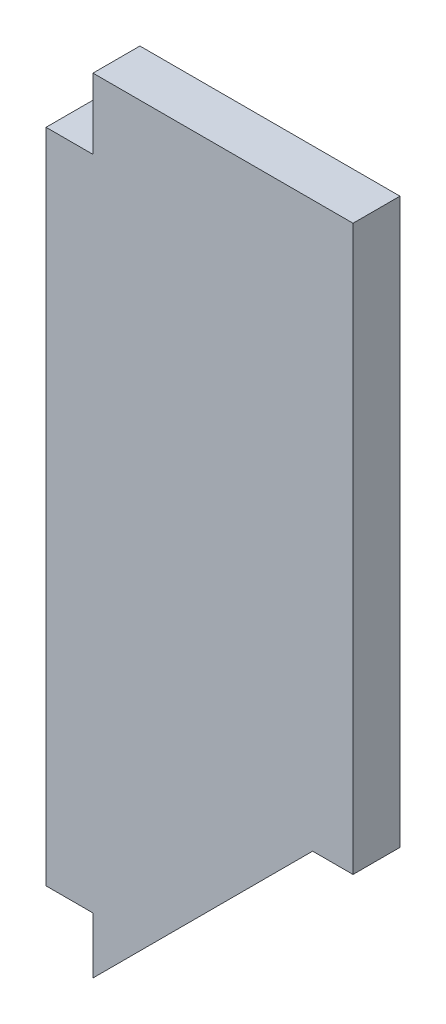
ISO-10303-21;
HEADER;
FILE_DESCRIPTION(('STEP AP214'),'2;1');
FILE_NAME('part.step','',(''),(''),'','','');
FILE_SCHEMA(('AUTOMOTIVE_DESIGN { 1 0 10303 214 1 1 1 1 }'));
ENDSEC;
DATA;
#1=APPLICATION_CONTEXT('core data for automotive mechanical design processes');
#2=APPLICATION_PROTOCOL_DEFINITION('international standard','automotive_design',2000,#1);
#3=PRODUCT_CONTEXT('',#1,'mechanical');
#4=PRODUCT('Part','Part','',(#3));
#5=PRODUCT_RELATED_PRODUCT_CATEGORY('part','',(#4));
#6=PRODUCT_DEFINITION_FORMATION('','',#4);
#7=PRODUCT_DEFINITION_CONTEXT('part definition',#1,'design');
#8=PRODUCT_DEFINITION('design','',#6,#7);
#9=PRODUCT_DEFINITION_SHAPE('','',#8);
#10=(LENGTH_UNIT() NAMED_UNIT(*) SI_UNIT(.MILLI.,.METRE.));
#11=(NAMED_UNIT(*) PLANE_ANGLE_UNIT() SI_UNIT($,.RADIAN.));
#12=(NAMED_UNIT(*) SI_UNIT($,.STERADIAN.) SOLID_ANGLE_UNIT());
#13=UNCERTAINTY_MEASURE_WITH_UNIT(LENGTH_MEASURE(1.E-05),#10,'distance_accuracy_value','');
#14=(GEOMETRIC_REPRESENTATION_CONTEXT(3) GLOBAL_UNCERTAINTY_ASSIGNED_CONTEXT((#13)) GLOBAL_UNIT_ASSIGNED_CONTEXT((#10,
#11,#12)) REPRESENTATION_CONTEXT('',''));
#15=CARTESIAN_POINT('',(0.,0.,0.));
#16=DIRECTION('',(0.,0.,1.));
#17=DIRECTION('',(1.,0.,0.));
#18=AXIS2_PLACEMENT_3D('',#15,#16,#17);
#19=CARTESIAN_POINT('',(0.,0.,12.7));
#20=DIRECTION('',(1.,0.,0.));
#21=DIRECTION('',(0.,1.,0.));
#22=AXIS2_PLACEMENT_3D('',#19,#20,#21);
#23=PLANE('',#22);
#24=DIRECTION('',(0.,-1.,0.));
#25=VECTOR('',#24,1.);
#26=CARTESIAN_POINT('',(0.,0.,12.7));
#27=LINE('',#26,#25);
#28=CARTESIAN_POINT('',(0.,-19.05,12.7));
#29=VERTEX_POINT('',#28);
#30=CARTESIAN_POINT('',(0.,-196.85,12.7));
#31=VERTEX_POINT('',#30);
#32=EDGE_CURVE('E122',#29,#31,#27,.T.);
#33=ORIENTED_EDGE('',*,*,#32,.F.);
#34=DIRECTION('',(0.,0.,1.));
#35=VECTOR('',#34,1.);
#36=CARTESIAN_POINT('',(0.,-19.05,0.));
#37=LINE('',#36,#35);
#38=CARTESIAN_POINT('',(0.,-19.05,0.));
#39=VERTEX_POINT('',#38);
#40=EDGE_CURVE('E109',#39,#29,#37,.T.);
#41=ORIENTED_EDGE('',*,*,#40,.F.);
#42=DIRECTION('',(0.,-1.,0.));
#43=VECTOR('',#42,1.);
#44=CARTESIAN_POINT('',(0.,0.,0.));
#45=LINE('',#44,#43);
#46=CARTESIAN_POINT('',(0.,-196.85,0.));
#47=VERTEX_POINT('',#46);
#48=EDGE_CURVE('E120',#39,#47,#45,.T.);
#49=ORIENTED_EDGE('',*,*,#48,.T.);
#50=DIRECTION('',(0.,0.,1.));
#51=VECTOR('',#50,1.);
#52=CARTESIAN_POINT('',(0.,-196.85,0.));
#53=LINE('',#52,#51);
#54=EDGE_CURVE('E181',#47,#31,#53,.T.);
#55=ORIENTED_EDGE('',*,*,#54,.T.);
#56=EDGE_LOOP('',(#33,#41,#49,#55));
#57=FACE_BOUND('',#56,.T.);
#58=ADVANCED_FACE('F35',(#57),#23,.F.);
#59=CARTESIAN_POINT('',(8.89000000000003,-215.9,12.7));
#60=DIRECTION('',(-0.707106781186548,0.707106781186547,0.));
#61=DIRECTION('',(-0.707106781186547,-0.707106781186548,0.));
#62=AXIS2_PLACEMENT_3D('',#59,#60,#61);
#63=PLANE('',#62);
#64=DIRECTION('',(0.707106781186547,0.707106781186548,0.));
#65=VECTOR('',#64,1.);
#66=CARTESIAN_POINT('',(8.89000000000003,-215.9,12.7));
#67=LINE('',#66,#65);
#68=CARTESIAN_POINT('',(12.7,-212.09,12.7));
#69=VERTEX_POINT('',#68);
#70=CARTESIAN_POINT('',(72.1486750348032,-152.641324965197,12.7));
#71=VERTEX_POINT('',#70);
#72=EDGE_CURVE('E175',#69,#71,#67,.T.);
#73=ORIENTED_EDGE('',*,*,#72,.F.);
#74=DIRECTION('',(0.,0.,-1.));
#75=VECTOR('',#74,1.);
#76=CARTESIAN_POINT('',(12.7,-212.09,12.7));
#77=LINE('',#76,#75);
#78=CARTESIAN_POINT('',(12.7,-212.09,0.));
#79=VERTEX_POINT('',#78);
#80=EDGE_CURVE('E126',#69,#79,#77,.T.);
#81=ORIENTED_EDGE('',*,*,#80,.T.);
#82=DIRECTION('',(0.707106781186547,0.707106781186548,0.));
#83=VECTOR('',#82,1.);
#84=CARTESIAN_POINT('',(8.89000000000003,-215.9,0.));
#85=LINE('',#84,#83);
#86=CARTESIAN_POINT('',(72.1486750348032,-152.641324965197,0.));
#87=VERTEX_POINT('',#86);
#88=EDGE_CURVE('E125',#79,#87,#85,.T.);
#89=ORIENTED_EDGE('',*,*,#88,.T.);
#90=DIRECTION('',(0.,0.,-1.));
#91=VECTOR('',#90,1.);
#92=CARTESIAN_POINT('',(72.1486750348032,-152.641324965197,12.7));
#93=LINE('',#92,#91);
#94=EDGE_CURVE('E42',#71,#87,#93,.T.);
#95=ORIENTED_EDGE('',*,*,#94,.F.);
#96=EDGE_LOOP('',(#73,#81,#89,#95));
#97=FACE_BOUND('',#96,.T.);
#98=ADVANCED_FACE('F205',(#97),#63,.F.);
#99=CARTESIAN_POINT('',(72.1486750348032,-152.641324965197,12.7));
#100=DIRECTION('',(0.,1.,0.));
#101=DIRECTION('',(0.,0.,1.));
#102=AXIS2_PLACEMENT_3D('',#99,#100,#101);
#103=PLANE('',#102);
#104=DIRECTION('',(1.,0.,0.));
#105=VECTOR('',#104,1.);
#106=CARTESIAN_POINT('',(72.1486750348032,-152.641324965197,0.));
#107=LINE('',#106,#105);
#108=CARTESIAN_POINT('',(83.0805412377398,-152.641324965197,0.));
#109=VERTEX_POINT('',#108);
#110=EDGE_CURVE('E128',#87,#109,#107,.T.);
#111=ORIENTED_EDGE('',*,*,#110,.T.);
#112=DIRECTION('',(0.,0.,-1.));
#113=VECTOR('',#112,1.);
#114=CARTESIAN_POINT('',(83.0805412377398,-152.641324965197,12.7));
#115=LINE('',#114,#113);
#116=CARTESIAN_POINT('',(83.0805412377398,-152.641324965197,12.7));
#117=VERTEX_POINT('',#116);
#118=EDGE_CURVE('E147',#117,#109,#115,.T.);
#119=ORIENTED_EDGE('',*,*,#118,.F.);
#120=DIRECTION('',(1.,0.,0.));
#121=VECTOR('',#120,1.);
#122=CARTESIAN_POINT('',(72.1486750348032,-152.641324965197,12.7));
#123=LINE('',#122,#121);
#124=EDGE_CURVE('E156',#71,#117,#123,.T.);
#125=ORIENTED_EDGE('',*,*,#124,.F.);
#126=ORIENTED_EDGE('',*,*,#94,.T.);
#127=EDGE_LOOP('',(#111,#119,#125,#126));
#128=FACE_BOUND('',#127,.T.);
#129=ADVANCED_FACE('F154',(#128),#103,.F.);
#130=CARTESIAN_POINT('',(83.0805412377398,0.,12.7));
#131=DIRECTION('',(-1.,0.,0.));
#132=DIRECTION('',(0.,-1.,0.));
#133=AXIS2_PLACEMENT_3D('',#130,#131,#132);
#134=PLANE('',#133);
#135=DIRECTION('',(0.,1.,0.));
#136=VECTOR('',#135,1.);
#137=CARTESIAN_POINT('',(83.0805412377398,0.,0.));
#138=LINE('',#137,#136);
#139=CARTESIAN_POINT('',(83.0805412377398,0.,0.));
#140=VERTEX_POINT('',#139);
#141=EDGE_CURVE('E138',#109,#140,#138,.T.);
#142=ORIENTED_EDGE('',*,*,#141,.T.);
#143=DIRECTION('',(0.,0.,-1.));
#144=VECTOR('',#143,1.);
#145=CARTESIAN_POINT('',(83.0805412377398,0.,12.7));
#146=LINE('',#145,#144);
#147=CARTESIAN_POINT('',(83.0805412377398,0.,12.7));
#148=VERTEX_POINT('',#147);
#149=EDGE_CURVE('E144',#148,#140,#146,.T.);
#150=ORIENTED_EDGE('',*,*,#149,.F.);
#151=DIRECTION('',(0.,1.,0.));
#152=VECTOR('',#151,1.);
#153=CARTESIAN_POINT('',(83.0805412377398,0.,12.7));
#154=LINE('',#153,#152);
#155=EDGE_CURVE('E134',#117,#148,#154,.T.);
#156=ORIENTED_EDGE('',*,*,#155,.F.);
#157=ORIENTED_EDGE('',*,*,#118,.T.);
#158=EDGE_LOOP('',(#142,#150,#156,#157));
#159=FACE_BOUND('',#158,.T.);
#160=ADVANCED_FACE('F164',(#159),#134,.F.);
#161=CARTESIAN_POINT('',(76.7305412377398,0.,12.7));
#162=DIRECTION('',(0.,-1.,0.));
#163=DIRECTION('',(0.,0.,-1.));
#164=AXIS2_PLACEMENT_3D('',#161,#162,#163);
#165=PLANE('',#164);
#166=DIRECTION('',(-1.,0.,0.));
#167=VECTOR('',#166,1.);
#168=CARTESIAN_POINT('',(76.7305412377398,0.,0.));
#169=LINE('',#168,#167);
#170=CARTESIAN_POINT('',(12.7,0.,0.));
#171=VERTEX_POINT('',#170);
#172=EDGE_CURVE('E140',#140,#171,#169,.T.);
#173=ORIENTED_EDGE('',*,*,#172,.T.);
#174=DIRECTION('',(0.,0.,1.));
#175=VECTOR('',#174,1.);
#176=CARTESIAN_POINT('',(12.7,0.,0.));
#177=LINE('',#176,#175);
#178=CARTESIAN_POINT('',(12.7,0.,12.7));
#179=VERTEX_POINT('',#178);
#180=EDGE_CURVE('E131',#171,#179,#177,.T.);
#181=ORIENTED_EDGE('',*,*,#180,.T.);
#182=DIRECTION('',(-1.,0.,0.));
#183=VECTOR('',#182,1.);
#184=CARTESIAN_POINT('',(76.7305412377398,0.,12.7));
#185=LINE('',#184,#183);
#186=EDGE_CURVE('E143',#148,#179,#185,.T.);
#187=ORIENTED_EDGE('',*,*,#186,.F.);
#188=ORIENTED_EDGE('',*,*,#149,.T.);
#189=EDGE_LOOP('',(#173,#181,#187,#188));
#190=FACE_BOUND('',#189,.T.);
#191=ADVANCED_FACE('F167',(#190),#165,.F.);
#192=CARTESIAN_POINT('',(0.,0.,12.7));
#193=DIRECTION('',(0.,0.,1.));
#194=DIRECTION('',(1.,0.,0.));
#195=AXIS2_PLACEMENT_3D('',#192,#193,#194);
#196=PLANE('',#195);
#197=DIRECTION('',(0.,1.,0.));
#198=VECTOR('',#197,1.);
#199=CARTESIAN_POINT('',(12.7,0.,12.7));
#200=LINE('',#199,#198);
#201=CARTESIAN_POINT('',(12.7,-19.05,12.7));
#202=VERTEX_POINT('',#201);
#203=EDGE_CURVE('E114',#202,#179,#200,.T.);
#204=ORIENTED_EDGE('',*,*,#203,.F.);
#205=DIRECTION('',(1.,0.,0.));
#206=VECTOR('',#205,1.);
#207=CARTESIAN_POINT('',(0.,-19.05,12.7));
#208=LINE('',#207,#206);
#209=EDGE_CURVE('E183',#29,#202,#208,.T.);
#210=ORIENTED_EDGE('',*,*,#209,.F.);
#211=ORIENTED_EDGE('',*,*,#32,.T.);
#212=DIRECTION('',(-1.,0.,0.));
#213=VECTOR('',#212,1.);
#214=CARTESIAN_POINT('',(0.,-196.85,12.7));
#215=LINE('',#214,#213);
#216=CARTESIAN_POINT('',(12.7,-196.85,12.7));
#217=VERTEX_POINT('',#216);
#218=EDGE_CURVE('E184',#217,#31,#215,.T.);
#219=ORIENTED_EDGE('',*,*,#218,.F.);
#220=DIRECTION('',(0.,1.,0.));
#221=VECTOR('',#220,1.);
#222=CARTESIAN_POINT('',(12.7,-215.9,12.7));
#223=LINE('',#222,#221);
#224=EDGE_CURVE('E186',#69,#217,#223,.T.);
#225=ORIENTED_EDGE('',*,*,#224,.F.);
#226=ORIENTED_EDGE('',*,*,#72,.T.);
#227=ORIENTED_EDGE('',*,*,#124,.T.);
#228=ORIENTED_EDGE('',*,*,#155,.T.);
#229=ORIENTED_EDGE('',*,*,#186,.T.);
#230=EDGE_LOOP('',(#204,#210,#211,#219,#225,#226,#227,#228,#229));
#231=FACE_BOUND('',#230,.T.);
#232=ADVANCED_FACE('F174',(#231),#196,.T.);
#233=CARTESIAN_POINT('',(0.,0.,0.));
#234=DIRECTION('',(0.,0.,1.));
#235=DIRECTION('',(1.,0.,0.));
#236=AXIS2_PLACEMENT_3D('',#233,#234,#235);
#237=PLANE('',#236);
#238=DIRECTION('',(1.,0.,0.));
#239=VECTOR('',#238,1.);
#240=CARTESIAN_POINT('',(0.,-19.05,0.));
#241=LINE('',#240,#239);
#242=CARTESIAN_POINT('',(12.7,-19.05,0.));
#243=VERTEX_POINT('',#242);
#244=EDGE_CURVE('E105',#39,#243,#241,.T.);
#245=ORIENTED_EDGE('',*,*,#244,.T.);
#246=DIRECTION('',(0.,1.,0.));
#247=VECTOR('',#246,1.);
#248=CARTESIAN_POINT('',(12.7,0.,0.));
#249=LINE('',#248,#247);
#250=EDGE_CURVE('E49',#243,#171,#249,.T.);
#251=ORIENTED_EDGE('',*,*,#250,.T.);
#252=ORIENTED_EDGE('',*,*,#172,.F.);
#253=ORIENTED_EDGE('',*,*,#141,.F.);
#254=ORIENTED_EDGE('',*,*,#110,.F.);
#255=ORIENTED_EDGE('',*,*,#88,.F.);
#256=DIRECTION('',(0.,1.,0.));
#257=VECTOR('',#256,1.);
#258=CARTESIAN_POINT('',(12.7,0.,0.));
#259=LINE('',#258,#257);
#260=CARTESIAN_POINT('',(12.7,-196.85,0.));
#261=VERTEX_POINT('',#260);
#262=EDGE_CURVE('E11',#79,#261,#259,.T.);
#263=ORIENTED_EDGE('',*,*,#262,.T.);
#264=DIRECTION('',(-1.,0.,0.));
#265=VECTOR('',#264,1.);
#266=CARTESIAN_POINT('',(0.,-196.85,0.));
#267=LINE('',#266,#265);
#268=EDGE_CURVE('E57',#261,#47,#267,.T.);
#269=ORIENTED_EDGE('',*,*,#268,.T.);
#270=ORIENTED_EDGE('',*,*,#48,.F.);
#271=EDGE_LOOP('',(#245,#251,#252,#253,#254,#255,#263,#269,#270));
#272=FACE_BOUND('',#271,.T.);
#273=ADVANCED_FACE('F124',(#272),#237,.F.);
#274=CARTESIAN_POINT('',(12.7,-215.9,0.));
#275=DIRECTION('',(1.,0.,0.));
#276=DIRECTION('',(0.,0.,-1.));
#277=AXIS2_PLACEMENT_3D('',#274,#275,#276);
#278=PLANE('',#277);
#279=ORIENTED_EDGE('',*,*,#224,.T.);
#280=DIRECTION('',(0.,0.,1.));
#281=VECTOR('',#280,1.);
#282=CARTESIAN_POINT('',(12.7,-196.85,0.));
#283=LINE('',#282,#281);
#284=EDGE_CURVE('E179',#261,#217,#283,.T.);
#285=ORIENTED_EDGE('',*,*,#284,.F.);
#286=ORIENTED_EDGE('',*,*,#262,.F.);
#287=ORIENTED_EDGE('',*,*,#80,.F.);
#288=EDGE_LOOP('',(#279,#285,#286,#287));
#289=FACE_BOUND('',#288,.T.);
#290=ADVANCED_FACE('F202',(#289),#278,.F.);
#291=CARTESIAN_POINT('',(0.,-196.85,0.));
#292=DIRECTION('',(0.,1.,0.));
#293=DIRECTION('',(0.,0.,1.));
#294=AXIS2_PLACEMENT_3D('',#291,#292,#293);
#295=PLANE('',#294);
#296=ORIENTED_EDGE('',*,*,#218,.T.);
#297=ORIENTED_EDGE('',*,*,#54,.F.);
#298=ORIENTED_EDGE('',*,*,#268,.F.);
#299=ORIENTED_EDGE('',*,*,#284,.T.);
#300=EDGE_LOOP('',(#296,#297,#298,#299));
#301=FACE_BOUND('',#300,.T.);
#302=ADVANCED_FACE('F195',(#301),#295,.F.);
#303=CARTESIAN_POINT('',(12.7,0.,0.));
#304=DIRECTION('',(1.,0.,0.));
#305=DIRECTION('',(0.,1.,0.));
#306=AXIS2_PLACEMENT_3D('',#303,#304,#305);
#307=PLANE('',#306);
#308=ORIENTED_EDGE('',*,*,#203,.T.);
#309=ORIENTED_EDGE('',*,*,#180,.F.);
#310=ORIENTED_EDGE('',*,*,#250,.F.);
#311=DIRECTION('',(0.,0.,1.));
#312=VECTOR('',#311,1.);
#313=CARTESIAN_POINT('',(12.7,-19.05,0.));
#314=LINE('',#313,#312);
#315=EDGE_CURVE('E111',#243,#202,#314,.T.);
#316=ORIENTED_EDGE('',*,*,#315,.T.);
#317=EDGE_LOOP('',(#308,#309,#310,#316));
#318=FACE_BOUND('',#317,.T.);
#319=ADVANCED_FACE('F193',(#318),#307,.F.);
#320=CARTESIAN_POINT('',(0.,-19.05,0.));
#321=DIRECTION('',(0.,-1.,0.));
#322=DIRECTION('',(0.,0.,-1.));
#323=AXIS2_PLACEMENT_3D('',#320,#321,#322);
#324=PLANE('',#323);
#325=ORIENTED_EDGE('',*,*,#209,.T.);
#326=ORIENTED_EDGE('',*,*,#315,.F.);
#327=ORIENTED_EDGE('',*,*,#244,.F.);
#328=ORIENTED_EDGE('',*,*,#40,.T.);
#329=EDGE_LOOP('',(#325,#326,#327,#328));
#330=FACE_BOUND('',#329,.T.);
#331=ADVANCED_FACE('F108',(#330),#324,.F.);
#332=CLOSED_SHELL('',(#58,#98,#129,#160,#191,#232,#273,#290,#302,#319,#331));
#333=MANIFOLD_SOLID_BREP('B2',#332);
#334=ADVANCED_BREP_SHAPE_REPRESENTATION('',(#18,#333),#14);
#335=SHAPE_DEFINITION_REPRESENTATION(#9,#334);
ENDSEC;
END-ISO-10303-21;
